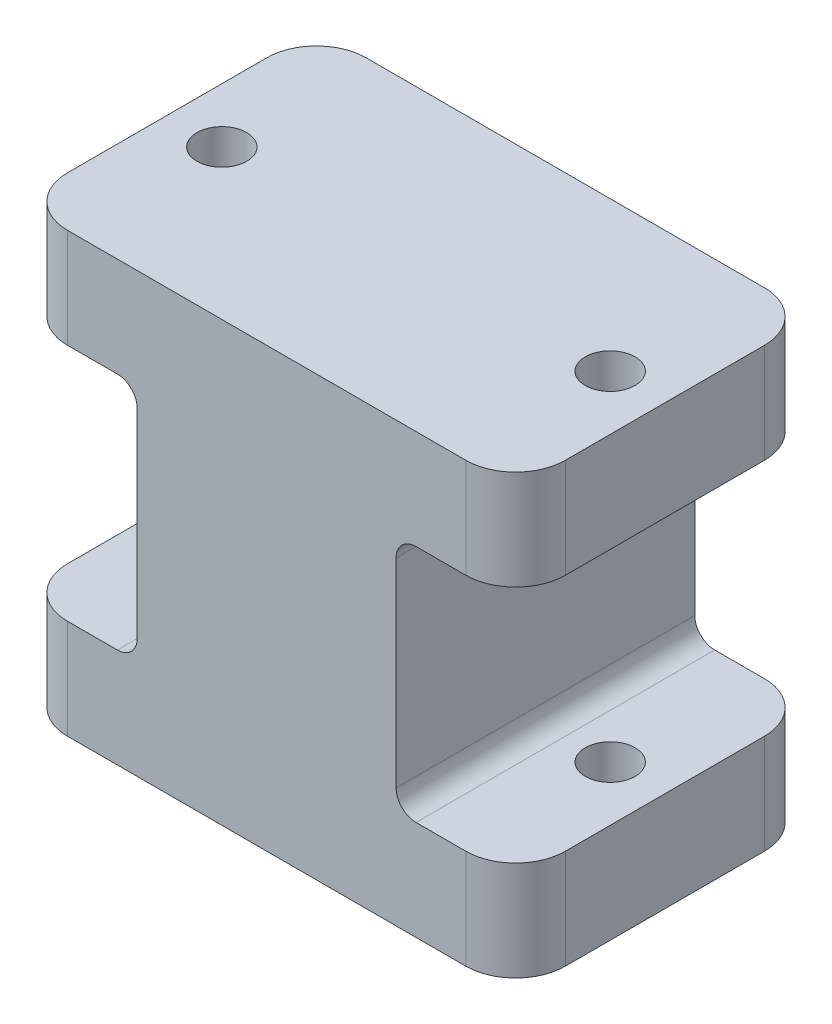
ISO-10303-21;
HEADER;
FILE_DESCRIPTION(('STEP AP214'),'2;1');
FILE_NAME('part.step','',(''),(''),'','','');
FILE_SCHEMA(('AUTOMOTIVE_DESIGN { 1 0 10303 214 1 1 1 1 }'));
ENDSEC;
DATA;
#1=APPLICATION_CONTEXT('core data for automotive mechanical design processes');
#2=APPLICATION_PROTOCOL_DEFINITION('international standard','automotive_design',2000,#1);
#3=PRODUCT_CONTEXT('',#1,'mechanical');
#4=PRODUCT('Part','Part','',(#3));
#5=PRODUCT_RELATED_PRODUCT_CATEGORY('part','',(#4));
#6=PRODUCT_DEFINITION_FORMATION('','',#4);
#7=PRODUCT_DEFINITION_CONTEXT('part definition',#1,'design');
#8=PRODUCT_DEFINITION('design','',#6,#7);
#9=PRODUCT_DEFINITION_SHAPE('','',#8);
#10=(LENGTH_UNIT() NAMED_UNIT(*) SI_UNIT(.MILLI.,.METRE.));
#11=(NAMED_UNIT(*) PLANE_ANGLE_UNIT() SI_UNIT($,.RADIAN.));
#12=(NAMED_UNIT(*) SI_UNIT($,.STERADIAN.) SOLID_ANGLE_UNIT());
#13=UNCERTAINTY_MEASURE_WITH_UNIT(LENGTH_MEASURE(1.E-05),#10,'distance_accuracy_value','');
#14=(GEOMETRIC_REPRESENTATION_CONTEXT(3) GLOBAL_UNCERTAINTY_ASSIGNED_CONTEXT((#13)) GLOBAL_UNIT_ASSIGNED_CONTEXT((#10,
#11,#12)) REPRESENTATION_CONTEXT('',''));
#15=CARTESIAN_POINT('',(0.,0.,0.));
#16=DIRECTION('',(0.,0.,1.));
#17=DIRECTION('',(1.,0.,0.));
#18=AXIS2_PLACEMENT_3D('',#15,#16,#17);
#19=CARTESIAN_POINT('',(20.,44.,10.));
#20=DIRECTION('',(0.,-1.,0.));
#21=DIRECTION('',(0.,0.,-1.));
#22=AXIS2_PLACEMENT_3D('',#19,#20,#21);
#23=CYLINDRICAL_SURFACE('',#22,5.);
#24=CARTESIAN_POINT('',(20.,9.99999999999999,10.));
#25=DIRECTION('',(0.,1.,0.));
#26=DIRECTION('',(0.,0.,1.));
#27=AXIS2_PLACEMENT_3D('',#24,#25,#26);
#28=CIRCLE('',#27,5.);
#29=CARTESIAN_POINT('',(20.,9.99999999999999,15.));
#30=VERTEX_POINT('',#29);
#31=CARTESIAN_POINT('',(25.,9.99999999999999,9.99999999999996));
#32=VERTEX_POINT('',#31);
#33=EDGE_CURVE('E415',#30,#32,#28,.T.);
#34=ORIENTED_EDGE('',*,*,#33,.F.);
#35=DIRECTION('',(0.,-1.,0.));
#36=VECTOR('',#35,1.);
#37=CARTESIAN_POINT('',(20.,44.,15.));
#38=LINE('',#37,#36);
#39=CARTESIAN_POINT('',(20.,0.,15.));
#40=VERTEX_POINT('',#39);
#41=EDGE_CURVE('E344',#30,#40,#38,.T.);
#42=ORIENTED_EDGE('',*,*,#41,.T.);
#43=CARTESIAN_POINT('',(20.,0.,10.));
#44=DIRECTION('',(0.,1.,0.));
#45=DIRECTION('',(0.,0.,1.));
#46=AXIS2_PLACEMENT_3D('',#43,#44,#45);
#47=CIRCLE('',#46,5.);
#48=CARTESIAN_POINT('',(25.,0.,9.99999999999996));
#49=VERTEX_POINT('',#48);
#50=EDGE_CURVE('E325',#40,#49,#47,.T.);
#51=ORIENTED_EDGE('',*,*,#50,.T.);
#52=DIRECTION('',(0.,-1.,0.));
#53=VECTOR('',#52,1.);
#54=CARTESIAN_POINT('',(25.,44.,9.99999999999996));
#55=LINE('',#54,#53);
#56=EDGE_CURVE('E219',#32,#49,#55,.T.);
#57=ORIENTED_EDGE('',*,*,#56,.F.);
#58=EDGE_LOOP('',(#34,#42,#51,#57));
#59=FACE_BOUND('',#58,.T.);
#60=ADVANCED_FACE('F33',(#59),#23,.T.);
#61=CARTESIAN_POINT('',(20.,34.,10.));
#62=DIRECTION('',(0.,-1.,0.));
#63=DIRECTION('',(0.,0.,-1.));
#64=AXIS2_PLACEMENT_3D('',#61,#62,#63);
#65=CIRCLE('',#64,5.);
#66=CARTESIAN_POINT('',(25.,34.,9.99999999999996));
#67=VERTEX_POINT('',#66);
#68=CARTESIAN_POINT('',(20.,34.,15.));
#69=VERTEX_POINT('',#68);
#70=EDGE_CURVE('E196',#67,#69,#65,.T.);
#71=ORIENTED_EDGE('',*,*,#70,.F.);
#72=CARTESIAN_POINT('',(25.,44.,9.99999999999996));
#73=VERTEX_POINT('',#72);
#74=EDGE_CURVE('E210',#73,#67,#55,.T.);
#75=ORIENTED_EDGE('',*,*,#74,.F.);
#76=CARTESIAN_POINT('',(20.,44.,10.));
#77=DIRECTION('',(0.,1.,0.));
#78=DIRECTION('',(0.,0.,1.));
#79=AXIS2_PLACEMENT_3D('',#76,#77,#78);
#80=CIRCLE('',#79,5.);
#81=CARTESIAN_POINT('',(20.,44.,15.));
#82=VERTEX_POINT('',#81);
#83=EDGE_CURVE('E328',#82,#73,#80,.T.);
#84=ORIENTED_EDGE('',*,*,#83,.F.);
#85=EDGE_CURVE('E212',#82,#69,#38,.T.);
#86=ORIENTED_EDGE('',*,*,#85,.T.);
#87=EDGE_LOOP('',(#71,#75,#84,#86));
#88=FACE_BOUND('',#87,.T.);
#89=ADVANCED_FACE('F208',(#88),#23,.T.);
#90=CARTESIAN_POINT('',(25.,44.,9.99999999999996));
#91=DIRECTION('',(-1.,0.,0.));
#92=DIRECTION('',(0.,0.,1.));
#93=AXIS2_PLACEMENT_3D('',#90,#91,#92);
#94=PLANE('',#93);
#95=DIRECTION('',(0.,0.,1.));
#96=VECTOR('',#95,1.);
#97=CARTESIAN_POINT('',(25.,9.99999999999999,15.));
#98=LINE('',#97,#96);
#99=CARTESIAN_POINT('',(25.,9.99999999999999,-10.));
#100=VERTEX_POINT('',#99);
#101=EDGE_CURVE('E204',#100,#32,#98,.T.);
#102=ORIENTED_EDGE('',*,*,#101,.T.);
#103=ORIENTED_EDGE('',*,*,#56,.T.);
#104=DIRECTION('',(0.,0.,-1.));
#105=VECTOR('',#104,1.);
#106=CARTESIAN_POINT('',(25.,0.,9.99999999999996));
#107=LINE('',#106,#105);
#108=CARTESIAN_POINT('',(25.,0.,-9.99999999999997));
#109=VERTEX_POINT('',#108);
#110=EDGE_CURVE('E347',#49,#109,#107,.T.);
#111=ORIENTED_EDGE('',*,*,#110,.T.);
#112=DIRECTION('',(0.,-1.,0.));
#113=VECTOR('',#112,1.);
#114=CARTESIAN_POINT('',(25.,44.,-9.99999999999997));
#115=LINE('',#114,#113);
#116=EDGE_CURVE('E386',#100,#109,#115,.T.);
#117=ORIENTED_EDGE('',*,*,#116,.F.);
#118=EDGE_LOOP('',(#102,#103,#111,#117));
#119=FACE_BOUND('',#118,.T.);
#120=ADVANCED_FACE('F446',(#119),#94,.F.);
#121=DIRECTION('',(0.,0.,-1.));
#122=VECTOR('',#121,1.);
#123=CARTESIAN_POINT('',(25.,34.,15.));
#124=LINE('',#123,#122);
#125=CARTESIAN_POINT('',(25.,34.,-10.));
#126=VERTEX_POINT('',#125);
#127=EDGE_CURVE('E192',#67,#126,#124,.T.);
#128=ORIENTED_EDGE('',*,*,#127,.T.);
#129=CARTESIAN_POINT('',(25.,44.,-9.99999999999997));
#130=VERTEX_POINT('',#129);
#131=EDGE_CURVE('E224',#130,#126,#115,.T.);
#132=ORIENTED_EDGE('',*,*,#131,.F.);
#133=DIRECTION('',(0.,0.,-1.));
#134=VECTOR('',#133,1.);
#135=CARTESIAN_POINT('',(25.,44.,9.99999999999996));
#136=LINE('',#135,#134);
#137=EDGE_CURVE('E216',#73,#130,#136,.T.);
#138=ORIENTED_EDGE('',*,*,#137,.F.);
#139=ORIENTED_EDGE('',*,*,#74,.T.);
#140=EDGE_LOOP('',(#128,#132,#138,#139));
#141=FACE_BOUND('',#140,.T.);
#142=ADVANCED_FACE('F215',(#141),#94,.F.);
#143=CARTESIAN_POINT('',(20.,44.,-10.));
#144=DIRECTION('',(0.,-1.,0.));
#145=DIRECTION('',(0.,0.,-1.));
#146=AXIS2_PLACEMENT_3D('',#143,#144,#145);
#147=CYLINDRICAL_SURFACE('',#146,5.);
#148=CARTESIAN_POINT('',(20.,9.99999999999999,-10.));
#149=DIRECTION('',(0.,1.,0.));
#150=DIRECTION('',(0.,0.,1.));
#151=AXIS2_PLACEMENT_3D('',#148,#149,#150);
#152=CIRCLE('',#151,5.);
#153=CARTESIAN_POINT('',(20.,9.99999999999999,-15.));
#154=VERTEX_POINT('',#153);
#155=EDGE_CURVE('E243',#100,#154,#152,.T.);
#156=ORIENTED_EDGE('',*,*,#155,.F.);
#157=ORIENTED_EDGE('',*,*,#116,.T.);
#158=CARTESIAN_POINT('',(20.,0.,-10.));
#159=DIRECTION('',(0.,1.,0.));
#160=DIRECTION('',(0.,0.,1.));
#161=AXIS2_PLACEMENT_3D('',#158,#159,#160);
#162=CIRCLE('',#161,5.);
#163=CARTESIAN_POINT('',(20.,0.,-15.));
#164=VERTEX_POINT('',#163);
#165=EDGE_CURVE('E350',#109,#164,#162,.T.);
#166=ORIENTED_EDGE('',*,*,#165,.T.);
#167=DIRECTION('',(0.,-1.,0.));
#168=VECTOR('',#167,1.);
#169=CARTESIAN_POINT('',(20.,44.,-15.));
#170=LINE('',#169,#168);
#171=EDGE_CURVE('E383',#154,#164,#170,.T.);
#172=ORIENTED_EDGE('',*,*,#171,.F.);
#173=EDGE_LOOP('',(#156,#157,#166,#172));
#174=FACE_BOUND('',#173,.T.);
#175=ADVANCED_FACE('F398',(#174),#147,.T.);
#176=CARTESIAN_POINT('',(20.,34.,-10.));
#177=DIRECTION('',(0.,-1.,0.));
#178=DIRECTION('',(0.,0.,-1.));
#179=AXIS2_PLACEMENT_3D('',#176,#177,#178);
#180=CIRCLE('',#179,5.);
#181=CARTESIAN_POINT('',(20.,34.,-15.));
#182=VERTEX_POINT('',#181);
#183=EDGE_CURVE('E199',#182,#126,#180,.T.);
#184=ORIENTED_EDGE('',*,*,#183,.F.);
#185=CARTESIAN_POINT('',(20.,44.,-15.));
#186=VERTEX_POINT('',#185);
#187=EDGE_CURVE('E384',#186,#182,#170,.T.);
#188=ORIENTED_EDGE('',*,*,#187,.F.);
#189=CARTESIAN_POINT('',(20.,44.,-10.));
#190=DIRECTION('',(0.,1.,0.));
#191=DIRECTION('',(0.,0.,1.));
#192=AXIS2_PLACEMENT_3D('',#189,#190,#191);
#193=CIRCLE('',#192,5.);
#194=EDGE_CURVE('E332',#130,#186,#193,.T.);
#195=ORIENTED_EDGE('',*,*,#194,.F.);
#196=ORIENTED_EDGE('',*,*,#131,.T.);
#197=EDGE_LOOP('',(#184,#188,#195,#196));
#198=FACE_BOUND('',#197,.T.);
#199=ADVANCED_FACE('F435',(#198),#147,.T.);
#200=CARTESIAN_POINT('',(20.,44.,-15.));
#201=DIRECTION('',(0.,0.,1.));
#202=DIRECTION('',(1.,0.,0.));
#203=AXIS2_PLACEMENT_3D('',#200,#201,#202);
#204=PLANE('',#203);
#205=DIRECTION('',(0.,-1.,0.));
#206=VECTOR('',#205,1.);
#207=CARTESIAN_POINT('',(13.,9.99999999999999,-15.));
#208=LINE('',#207,#206);
#209=CARTESIAN_POINT('',(13.,32.,-15.));
#210=VERTEX_POINT('',#209);
#211=CARTESIAN_POINT('',(13.,12.,-15.));
#212=VERTEX_POINT('',#211);
#213=EDGE_CURVE('E628',#210,#212,#208,.T.);
#214=ORIENTED_EDGE('',*,*,#213,.T.);
#215=CARTESIAN_POINT('',(15.,12.,-15.));
#216=DIRECTION('',(0.,0.,1.));
#217=DIRECTION('',(1.,0.,0.));
#218=AXIS2_PLACEMENT_3D('',#215,#216,#217);
#219=CIRCLE('',#218,2.);
#220=CARTESIAN_POINT('',(15.,9.99999999999999,-15.));
#221=VERTEX_POINT('',#220);
#222=EDGE_CURVE('E266',#212,#221,#219,.T.);
#223=ORIENTED_EDGE('',*,*,#222,.T.);
#224=DIRECTION('',(1.,0.,0.));
#225=VECTOR('',#224,1.);
#226=CARTESIAN_POINT('',(13.,9.99999999999999,-15.));
#227=LINE('',#226,#225);
#228=EDGE_CURVE('E241',#221,#154,#227,.T.);
#229=ORIENTED_EDGE('',*,*,#228,.T.);
#230=ORIENTED_EDGE('',*,*,#171,.T.);
#231=DIRECTION('',(-1.,0.,0.));
#232=VECTOR('',#231,1.);
#233=CARTESIAN_POINT('',(20.,0.,-15.));
#234=LINE('',#233,#232);
#235=CARTESIAN_POINT('',(-20.,0.,-15.));
#236=VERTEX_POINT('',#235);
#237=EDGE_CURVE('E353',#164,#236,#234,.T.);
#238=ORIENTED_EDGE('',*,*,#237,.T.);
#239=DIRECTION('',(0.,-1.,0.));
#240=VECTOR('',#239,1.);
#241=CARTESIAN_POINT('',(-20.,44.,-15.));
#242=LINE('',#241,#240);
#243=CARTESIAN_POINT('',(-20.,9.99999999999999,-15.));
#244=VERTEX_POINT('',#243);
#245=EDGE_CURVE('E380',#244,#236,#242,.T.);
#246=ORIENTED_EDGE('',*,*,#245,.F.);
#247=DIRECTION('',(-1.,0.,0.));
#248=VECTOR('',#247,1.);
#249=CARTESIAN_POINT('',(-13.,9.99999999999999,-15.));
#250=LINE('',#249,#248);
#251=CARTESIAN_POINT('',(-15.,9.99999999999999,-15.));
#252=VERTEX_POINT('',#251);
#253=EDGE_CURVE('E278',#252,#244,#250,.T.);
#254=ORIENTED_EDGE('',*,*,#253,.F.);
#255=CARTESIAN_POINT('',(-15.,12.,-15.));
#256=DIRECTION('',(0.,0.,1.));
#257=DIRECTION('',(1.,0.,0.));
#258=AXIS2_PLACEMENT_3D('',#255,#256,#257);
#259=CIRCLE('',#258,2.);
#260=CARTESIAN_POINT('',(-13.,12.,-15.));
#261=VERTEX_POINT('',#260);
#262=EDGE_CURVE('E270',#252,#261,#259,.T.);
#263=ORIENTED_EDGE('',*,*,#262,.T.);
#264=DIRECTION('',(0.,-1.,0.));
#265=VECTOR('',#264,1.);
#266=CARTESIAN_POINT('',(-13.,9.99999999999999,-15.));
#267=LINE('',#266,#265);
#268=CARTESIAN_POINT('',(-13.,32.,-15.));
#269=VERTEX_POINT('',#268);
#270=EDGE_CURVE('E276',#269,#261,#267,.T.);
#271=ORIENTED_EDGE('',*,*,#270,.F.);
#272=CARTESIAN_POINT('',(-15.,32.,-15.));
#273=DIRECTION('',(0.,0.,1.));
#274=DIRECTION('',(1.,0.,0.));
#275=AXIS2_PLACEMENT_3D('',#272,#273,#274);
#276=CIRCLE('',#275,2.);
#277=CARTESIAN_POINT('',(-15.,34.,-15.));
#278=VERTEX_POINT('',#277);
#279=EDGE_CURVE('E41',#269,#278,#276,.T.);
#280=ORIENTED_EDGE('',*,*,#279,.T.);
#281=DIRECTION('',(-1.,0.,0.));
#282=VECTOR('',#281,1.);
#283=CARTESIAN_POINT('',(-13.,34.,-15.));
#284=LINE('',#283,#282);
#285=CARTESIAN_POINT('',(-20.,34.,-15.));
#286=VERTEX_POINT('',#285);
#287=EDGE_CURVE('E232',#278,#286,#284,.T.);
#288=ORIENTED_EDGE('',*,*,#287,.T.);
#289=CARTESIAN_POINT('',(-20.,44.,-15.));
#290=VERTEX_POINT('',#289);
#291=EDGE_CURVE('E381',#290,#286,#242,.T.);
#292=ORIENTED_EDGE('',*,*,#291,.F.);
#293=DIRECTION('',(-1.,0.,0.));
#294=VECTOR('',#293,1.);
#295=CARTESIAN_POINT('',(20.,44.,-15.));
#296=LINE('',#295,#294);
#297=EDGE_CURVE('E334',#186,#290,#296,.T.);
#298=ORIENTED_EDGE('',*,*,#297,.F.);
#299=ORIENTED_EDGE('',*,*,#187,.T.);
#300=DIRECTION('',(1.,0.,0.));
#301=VECTOR('',#300,1.);
#302=CARTESIAN_POINT('',(13.,34.,-15.));
#303=LINE('',#302,#301);
#304=CARTESIAN_POINT('',(15.,34.,-15.));
#305=VERTEX_POINT('',#304);
#306=EDGE_CURVE('E438',#305,#182,#303,.T.);
#307=ORIENTED_EDGE('',*,*,#306,.F.);
#308=CARTESIAN_POINT('',(15.,32.,-15.));
#309=DIRECTION('',(0.,0.,1.));
#310=DIRECTION('',(1.,0.,0.));
#311=AXIS2_PLACEMENT_3D('',#308,#309,#310);
#312=CIRCLE('',#311,2.);
#313=EDGE_CURVE('E260',#305,#210,#312,.T.);
#314=ORIENTED_EDGE('',*,*,#313,.T.);
#315=EDGE_LOOP('',(#214,#223,#229,#230,#238,#246,#254,#263,#271,#280,#288,#292,#298,#299,#307,#314));
#316=FACE_BOUND('',#315,.T.);
#317=ADVANCED_FACE('F275',(#316),#204,.F.);
#318=CARTESIAN_POINT('',(20.,44.,15.));
#319=DIRECTION('',(0.,0.,-1.));
#320=DIRECTION('',(-1.,0.,0.));
#321=AXIS2_PLACEMENT_3D('',#318,#319,#320);
#322=PLANE('',#321);
#323=DIRECTION('',(1.,0.,0.));
#324=VECTOR('',#323,1.);
#325=CARTESIAN_POINT('',(13.,9.99999999999999,15.));
#326=LINE('',#325,#324);
#327=CARTESIAN_POINT('',(15.,9.99999999999999,15.));
#328=VERTEX_POINT('',#327);
#329=EDGE_CURVE('E639',#328,#30,#326,.T.);
#330=ORIENTED_EDGE('',*,*,#329,.F.);
#331=CARTESIAN_POINT('',(15.,12.,15.));
#332=DIRECTION('',(0.,0.,-1.));
#333=DIRECTION('',(-1.,0.,0.));
#334=AXIS2_PLACEMENT_3D('',#331,#332,#333);
#335=CIRCLE('',#334,2.);
#336=CARTESIAN_POINT('',(13.,12.,15.));
#337=VERTEX_POINT('',#336);
#338=EDGE_CURVE('E264',#328,#337,#335,.T.);
#339=ORIENTED_EDGE('',*,*,#338,.T.);
#340=DIRECTION('',(0.,1.,0.));
#341=VECTOR('',#340,1.);
#342=CARTESIAN_POINT('',(13.,9.99999999999999,15.));
#343=LINE('',#342,#341);
#344=CARTESIAN_POINT('',(13.,32.,15.));
#345=VERTEX_POINT('',#344);
#346=EDGE_CURVE('E634',#337,#345,#343,.T.);
#347=ORIENTED_EDGE('',*,*,#346,.T.);
#348=CARTESIAN_POINT('',(15.,32.,15.));
#349=DIRECTION('',(0.,0.,-1.));
#350=DIRECTION('',(-1.,0.,0.));
#351=AXIS2_PLACEMENT_3D('',#348,#349,#350);
#352=CIRCLE('',#351,2.);
#353=CARTESIAN_POINT('',(15.,34.,15.));
#354=VERTEX_POINT('',#353);
#355=EDGE_CURVE('E262',#345,#354,#352,.T.);
#356=ORIENTED_EDGE('',*,*,#355,.T.);
#357=DIRECTION('',(1.,0.,0.));
#358=VECTOR('',#357,1.);
#359=CARTESIAN_POINT('',(13.,34.,15.));
#360=LINE('',#359,#358);
#361=EDGE_CURVE('E638',#354,#69,#360,.T.);
#362=ORIENTED_EDGE('',*,*,#361,.T.);
#363=ORIENTED_EDGE('',*,*,#85,.F.);
#364=DIRECTION('',(1.,0.,0.));
#365=VECTOR('',#364,1.);
#366=CARTESIAN_POINT('',(20.,44.,15.));
#367=LINE('',#366,#365);
#368=CARTESIAN_POINT('',(-20.,44.,15.));
#369=VERTEX_POINT('',#368);
#370=EDGE_CURVE('E342',#369,#82,#367,.T.);
#371=ORIENTED_EDGE('',*,*,#370,.F.);
#372=DIRECTION('',(0.,-1.,0.));
#373=VECTOR('',#372,1.);
#374=CARTESIAN_POINT('',(-20.,44.,15.));
#375=LINE('',#374,#373);
#376=CARTESIAN_POINT('',(-20.,34.,15.));
#377=VERTEX_POINT('',#376);
#378=EDGE_CURVE('E369',#369,#377,#375,.T.);
#379=ORIENTED_EDGE('',*,*,#378,.T.);
#380=DIRECTION('',(-1.,0.,0.));
#381=VECTOR('',#380,1.);
#382=CARTESIAN_POINT('',(-13.,34.,15.));
#383=LINE('',#382,#381);
#384=CARTESIAN_POINT('',(-15.,34.,15.));
#385=VERTEX_POINT('',#384);
#386=EDGE_CURVE('E301',#385,#377,#383,.T.);
#387=ORIENTED_EDGE('',*,*,#386,.F.);
#388=CARTESIAN_POINT('',(-15.,32.,15.));
#389=DIRECTION('',(0.,0.,-1.));
#390=DIRECTION('',(-1.,0.,0.));
#391=AXIS2_PLACEMENT_3D('',#388,#389,#390);
#392=CIRCLE('',#391,2.);
#393=CARTESIAN_POINT('',(-13.,32.,15.));
#394=VERTEX_POINT('',#393);
#395=EDGE_CURVE('E11',#385,#394,#392,.T.);
#396=ORIENTED_EDGE('',*,*,#395,.T.);
#397=DIRECTION('',(0.,1.,0.));
#398=VECTOR('',#397,1.);
#399=CARTESIAN_POINT('',(-13.,9.99999999999999,15.));
#400=LINE('',#399,#398);
#401=CARTESIAN_POINT('',(-13.,12.,15.));
#402=VERTEX_POINT('',#401);
#403=EDGE_CURVE('E287',#402,#394,#400,.T.);
#404=ORIENTED_EDGE('',*,*,#403,.F.);
#405=CARTESIAN_POINT('',(-15.,12.,15.));
#406=DIRECTION('',(0.,0.,-1.));
#407=DIRECTION('',(-1.,0.,0.));
#408=AXIS2_PLACEMENT_3D('',#405,#406,#407);
#409=CIRCLE('',#408,2.);
#410=CARTESIAN_POINT('',(-15.,9.99999999999999,15.));
#411=VERTEX_POINT('',#410);
#412=EDGE_CURVE('E268',#402,#411,#409,.T.);
#413=ORIENTED_EDGE('',*,*,#412,.T.);
#414=DIRECTION('',(-1.,0.,0.));
#415=VECTOR('',#414,1.);
#416=CARTESIAN_POINT('',(-13.,9.99999999999999,15.));
#417=LINE('',#416,#415);
#418=CARTESIAN_POINT('',(-20.,9.99999999999999,15.));
#419=VERTEX_POINT('',#418);
#420=EDGE_CURVE('E295',#411,#419,#417,.T.);
#421=ORIENTED_EDGE('',*,*,#420,.T.);
#422=CARTESIAN_POINT('',(-20.,0.,15.));
#423=VERTEX_POINT('',#422);
#424=EDGE_CURVE('E368',#419,#423,#375,.T.);
#425=ORIENTED_EDGE('',*,*,#424,.T.);
#426=DIRECTION('',(1.,0.,0.));
#427=VECTOR('',#426,1.);
#428=CARTESIAN_POINT('',(20.,0.,15.));
#429=LINE('',#428,#427);
#430=EDGE_CURVE('E330',#423,#40,#429,.T.);
#431=ORIENTED_EDGE('',*,*,#430,.T.);
#432=ORIENTED_EDGE('',*,*,#41,.F.);
#433=EDGE_LOOP('',(#330,#339,#347,#356,#362,#363,#371,#379,#387,#396,#404,#413,#421,#425,#431,#432));
#434=FACE_BOUND('',#433,.T.);
#435=ADVANCED_FACE('F294',(#434),#322,.F.);
#436=CARTESIAN_POINT('',(19.5,44.,0.));
#437=DIRECTION('',(0.,-1.,0.));
#438=DIRECTION('',(0.,0.,-1.));
#439=AXIS2_PLACEMENT_3D('',#436,#437,#438);
#440=CYLINDRICAL_SURFACE('',#439,2.5);
#441=CARTESIAN_POINT('',(19.5,0.,0.));
#442=DIRECTION('',(0.,1.,0.));
#443=DIRECTION('',(0.,0.,-1.));
#444=AXIS2_PLACEMENT_3D('',#441,#442,#443);
#445=CIRCLE('',#444,2.5);
#446=CARTESIAN_POINT('',(19.5,0.,-2.5));
#447=VERTEX_POINT('',#446);
#448=EDGE_CURVE('E315',#447,#447,#445,.T.);
#449=ORIENTED_EDGE('',*,*,#448,.F.);
#450=EDGE_LOOP('',(#449));
#451=FACE_BOUND('',#450,.T.);
#452=CARTESIAN_POINT('',(19.5,9.99999999999999,0.));
#453=DIRECTION('',(0.,1.,0.));
#454=DIRECTION('',(0.,0.,1.));
#455=AXIS2_PLACEMENT_3D('',#452,#453,#454);
#456=CIRCLE('',#455,2.5);
#457=CARTESIAN_POINT('',(19.5,9.99999999999999,2.5));
#458=VERTEX_POINT('',#457);
#459=EDGE_CURVE('E213',#458,#458,#456,.T.);
#460=ORIENTED_EDGE('',*,*,#459,.T.);
#461=EDGE_LOOP('',(#460));
#462=FACE_BOUND('',#461,.T.);
#463=ADVANCED_FACE('F599',(#451,#462),#440,.F.);
#464=CARTESIAN_POINT('',(19.5,44.,0.));
#465=DIRECTION('',(0.,1.,0.));
#466=DIRECTION('',(0.,0.,-1.));
#467=AXIS2_PLACEMENT_3D('',#464,#465,#466);
#468=CIRCLE('',#467,2.5);
#469=CARTESIAN_POINT('',(19.5,44.,-2.5));
#470=VERTEX_POINT('',#469);
#471=EDGE_CURVE('E316',#470,#470,#468,.T.);
#472=ORIENTED_EDGE('',*,*,#471,.T.);
#473=EDGE_LOOP('',(#472));
#474=FACE_BOUND('',#473,.T.);
#475=CARTESIAN_POINT('',(19.5,34.,0.));
#476=DIRECTION('',(0.,-1.,0.));
#477=DIRECTION('',(0.,0.,-1.));
#478=AXIS2_PLACEMENT_3D('',#475,#476,#477);
#479=CIRCLE('',#478,2.5);
#480=CARTESIAN_POINT('',(19.5,34.,-2.5));
#481=VERTEX_POINT('',#480);
#482=EDGE_CURVE('E238',#481,#481,#479,.T.);
#483=ORIENTED_EDGE('',*,*,#482,.T.);
#484=EDGE_LOOP('',(#483));
#485=FACE_BOUND('',#484,.T.);
#486=ADVANCED_FACE('F502',(#474,#485),#440,.F.);
#487=CARTESIAN_POINT('',(-20.,44.,-9.99999999999999));
#488=DIRECTION('',(0.,-1.,0.));
#489=DIRECTION('',(0.,0.,-1.));
#490=AXIS2_PLACEMENT_3D('',#487,#488,#489);
#491=CYLINDRICAL_SURFACE('',#490,5.);
#492=ORIENTED_EDGE('',*,*,#291,.T.);
#493=CARTESIAN_POINT('',(-20.,34.,-9.99999999999999));
#494=DIRECTION('',(0.,1.,0.));
#495=DIRECTION('',(0.,0.,1.));
#496=AXIS2_PLACEMENT_3D('',#493,#494,#495);
#497=CIRCLE('',#496,5.);
#498=CARTESIAN_POINT('',(-25.,34.,-9.99999999999996));
#499=VERTEX_POINT('',#498);
#500=EDGE_CURVE('E312',#286,#499,#497,.T.);
#501=ORIENTED_EDGE('',*,*,#500,.T.);
#502=DIRECTION('',(0.,-1.,0.));
#503=VECTOR('',#502,1.);
#504=CARTESIAN_POINT('',(-25.,44.,-9.99999999999996));
#505=LINE('',#504,#503);
#506=CARTESIAN_POINT('',(-25.,44.,-9.99999999999996));
#507=VERTEX_POINT('',#506);
#508=EDGE_CURVE('E377',#507,#499,#505,.T.);
#509=ORIENTED_EDGE('',*,*,#508,.F.);
#510=CARTESIAN_POINT('',(-20.,44.,-9.99999999999999));
#511=DIRECTION('',(0.,1.,0.));
#512=DIRECTION('',(0.,0.,1.));
#513=AXIS2_PLACEMENT_3D('',#510,#511,#512);
#514=CIRCLE('',#513,5.);
#515=EDGE_CURVE('E336',#290,#507,#514,.T.);
#516=ORIENTED_EDGE('',*,*,#515,.F.);
#517=EDGE_LOOP('',(#492,#501,#509,#516));
#518=FACE_BOUND('',#517,.T.);
#519=ADVANCED_FACE('F427',(#518),#491,.T.);
#520=CARTESIAN_POINT('',(-25.,44.,9.99999999999997));
#521=DIRECTION('',(1.,0.,0.));
#522=DIRECTION('',(0.,0.,-1.));
#523=AXIS2_PLACEMENT_3D('',#520,#521,#522);
#524=PLANE('',#523);
#525=ORIENTED_EDGE('',*,*,#508,.T.);
#526=DIRECTION('',(0.,0.,-1.));
#527=VECTOR('',#526,1.);
#528=CARTESIAN_POINT('',(-25.,34.,15.));
#529=LINE('',#528,#527);
#530=CARTESIAN_POINT('',(-25.,34.,10.));
#531=VERTEX_POINT('',#530);
#532=EDGE_CURVE('E288',#531,#499,#529,.T.);
#533=ORIENTED_EDGE('',*,*,#532,.F.);
#534=DIRECTION('',(0.,-1.,0.));
#535=VECTOR('',#534,1.);
#536=CARTESIAN_POINT('',(-25.,44.,9.99999999999997));
#537=LINE('',#536,#535);
#538=CARTESIAN_POINT('',(-25.,44.,9.99999999999997));
#539=VERTEX_POINT('',#538);
#540=EDGE_CURVE('E373',#539,#531,#537,.T.);
#541=ORIENTED_EDGE('',*,*,#540,.F.);
#542=DIRECTION('',(0.,0.,1.));
#543=VECTOR('',#542,1.);
#544=CARTESIAN_POINT('',(-25.,44.,9.99999999999997));
#545=LINE('',#544,#543);
#546=EDGE_CURVE('E338',#507,#539,#545,.T.);
#547=ORIENTED_EDGE('',*,*,#546,.F.);
#548=EDGE_LOOP('',(#525,#533,#541,#547));
#549=FACE_BOUND('',#548,.T.);
#550=ADVANCED_FACE('F466',(#549),#524,.F.);
#551=CARTESIAN_POINT('',(-20.,44.,10.));
#552=DIRECTION('',(0.,-1.,0.));
#553=DIRECTION('',(0.,0.,-1.));
#554=AXIS2_PLACEMENT_3D('',#551,#552,#553);
#555=CYLINDRICAL_SURFACE('',#554,5.);
#556=ORIENTED_EDGE('',*,*,#540,.T.);
#557=CARTESIAN_POINT('',(-20.,34.,10.));
#558=DIRECTION('',(0.,1.,0.));
#559=DIRECTION('',(0.,0.,1.));
#560=AXIS2_PLACEMENT_3D('',#557,#558,#559);
#561=CIRCLE('',#560,5.);
#562=EDGE_CURVE('E236',#531,#377,#561,.T.);
#563=ORIENTED_EDGE('',*,*,#562,.T.);
#564=ORIENTED_EDGE('',*,*,#378,.F.);
#565=CARTESIAN_POINT('',(-20.,44.,10.));
#566=DIRECTION('',(0.,1.,0.));
#567=DIRECTION('',(0.,0.,-1.));
#568=AXIS2_PLACEMENT_3D('',#565,#566,#567);
#569=CIRCLE('',#568,5.);
#570=EDGE_CURVE('E340',#539,#369,#569,.T.);
#571=ORIENTED_EDGE('',*,*,#570,.F.);
#572=EDGE_LOOP('',(#556,#563,#564,#571));
#573=FACE_BOUND('',#572,.T.);
#574=ADVANCED_FACE('F457',(#573),#555,.T.);
#575=CARTESIAN_POINT('',(-19.5,44.,0.));
#576=DIRECTION('',(0.,-1.,0.));
#577=DIRECTION('',(0.,0.,-1.));
#578=AXIS2_PLACEMENT_3D('',#575,#576,#577);
#579=CYLINDRICAL_SURFACE('',#578,2.5);
#580=CARTESIAN_POINT('',(-19.5,34.,0.));
#581=DIRECTION('',(0.,1.,0.));
#582=DIRECTION('',(0.,0.,1.));
#583=AXIS2_PLACEMENT_3D('',#580,#581,#582);
#584=CIRCLE('',#583,2.5);
#585=CARTESIAN_POINT('',(-19.5,34.,2.5));
#586=VERTEX_POINT('',#585);
#587=EDGE_CURVE('E233',#586,#586,#584,.T.);
#588=ORIENTED_EDGE('',*,*,#587,.F.);
#589=EDGE_LOOP('',(#588));
#590=FACE_BOUND('',#589,.T.);
#591=CARTESIAN_POINT('',(-19.5,44.,0.));
#592=DIRECTION('',(0.,1.,0.));
#593=DIRECTION('',(0.,0.,1.));
#594=AXIS2_PLACEMENT_3D('',#591,#592,#593);
#595=CIRCLE('',#594,2.5);
#596=CARTESIAN_POINT('',(-19.5,44.,2.5));
#597=VERTEX_POINT('',#596);
#598=EDGE_CURVE('E322',#597,#597,#595,.T.);
#599=ORIENTED_EDGE('',*,*,#598,.T.);
#600=EDGE_LOOP('',(#599));
#601=FACE_BOUND('',#600,.T.);
#602=ADVANCED_FACE('F464',(#590,#601),#579,.F.);
#603=CARTESIAN_POINT('',(20.,44.,10.));
#604=DIRECTION('',(0.,1.,0.));
#605=DIRECTION('',(0.,0.,1.));
#606=AXIS2_PLACEMENT_3D('',#603,#604,#605);
#607=PLANE('',#606);
#608=ORIENTED_EDGE('',*,*,#598,.F.);
#609=EDGE_LOOP('',(#608));
#610=FACE_BOUND('',#609,.T.);
#611=ORIENTED_EDGE('',*,*,#83,.T.);
#612=ORIENTED_EDGE('',*,*,#137,.T.);
#613=ORIENTED_EDGE('',*,*,#194,.T.);
#614=ORIENTED_EDGE('',*,*,#297,.T.);
#615=ORIENTED_EDGE('',*,*,#515,.T.);
#616=ORIENTED_EDGE('',*,*,#546,.T.);
#617=ORIENTED_EDGE('',*,*,#570,.T.);
#618=ORIENTED_EDGE('',*,*,#370,.T.);
#619=EDGE_LOOP('',(#611,#612,#613,#614,#615,#616,#617,#618));
#620=FACE_BOUND('',#619,.T.);
#621=ORIENTED_EDGE('',*,*,#471,.F.);
#622=EDGE_LOOP('',(#621));
#623=FACE_BOUND('',#622,.T.);
#624=ADVANCED_FACE('F430',(#610,#620,#623),#607,.T.);
#625=CARTESIAN_POINT('',(20.,0.,10.));
#626=DIRECTION('',(0.,1.,0.));
#627=DIRECTION('',(0.,0.,1.));
#628=AXIS2_PLACEMENT_3D('',#625,#626,#627);
#629=PLANE('',#628);
#630=ORIENTED_EDGE('',*,*,#50,.F.);
#631=ORIENTED_EDGE('',*,*,#430,.F.);
#632=CARTESIAN_POINT('',(-20.,0.,10.));
#633=DIRECTION('',(0.,1.,0.));
#634=DIRECTION('',(0.,0.,-1.));
#635=AXIS2_PLACEMENT_3D('',#632,#633,#634);
#636=CIRCLE('',#635,5.);
#637=CARTESIAN_POINT('',(-25.,0.,9.99999999999997));
#638=VERTEX_POINT('',#637);
#639=EDGE_CURVE('E362',#638,#423,#636,.T.);
#640=ORIENTED_EDGE('',*,*,#639,.F.);
#641=DIRECTION('',(0.,0.,1.));
#642=VECTOR('',#641,1.);
#643=CARTESIAN_POINT('',(-25.,0.,9.99999999999997));
#644=LINE('',#643,#642);
#645=CARTESIAN_POINT('',(-25.,0.,-9.99999999999996));
#646=VERTEX_POINT('',#645);
#647=EDGE_CURVE('E359',#646,#638,#644,.T.);
#648=ORIENTED_EDGE('',*,*,#647,.F.);
#649=CARTESIAN_POINT('',(-20.,0.,-9.99999999999999));
#650=DIRECTION('',(0.,1.,0.));
#651=DIRECTION('',(0.,0.,1.));
#652=AXIS2_PLACEMENT_3D('',#649,#650,#651);
#653=CIRCLE('',#652,5.);
#654=EDGE_CURVE('E356',#236,#646,#653,.T.);
#655=ORIENTED_EDGE('',*,*,#654,.F.);
#656=ORIENTED_EDGE('',*,*,#237,.F.);
#657=ORIENTED_EDGE('',*,*,#165,.F.);
#658=ORIENTED_EDGE('',*,*,#110,.F.);
#659=EDGE_LOOP('',(#630,#631,#640,#648,#655,#656,#657,#658));
#660=FACE_BOUND('',#659,.T.);
#661=CARTESIAN_POINT('',(-19.5,0.,0.));
#662=DIRECTION('',(0.,1.,0.));
#663=DIRECTION('',(0.,0.,1.));
#664=AXIS2_PLACEMENT_3D('',#661,#662,#663);
#665=CIRCLE('',#664,2.5);
#666=CARTESIAN_POINT('',(-19.5,0.,2.5));
#667=VERTEX_POINT('',#666);
#668=EDGE_CURVE('E319',#667,#667,#665,.T.);
#669=ORIENTED_EDGE('',*,*,#668,.T.);
#670=EDGE_LOOP('',(#669));
#671=FACE_BOUND('',#670,.T.);
#672=ORIENTED_EDGE('',*,*,#448,.T.);
#673=EDGE_LOOP('',(#672));
#674=FACE_BOUND('',#673,.T.);
#675=ADVANCED_FACE('F403',(#660,#671,#674),#629,.F.);
#676=CARTESIAN_POINT('',(-25.,9.99999999999999,-9.99999999999996));
#677=VERTEX_POINT('',#676);
#678=EDGE_CURVE('E376',#677,#646,#505,.T.);
#679=ORIENTED_EDGE('',*,*,#678,.F.);
#680=CARTESIAN_POINT('',(-20.,9.99999999999999,-9.99999999999999));
#681=DIRECTION('',(0.,-1.,0.));
#682=DIRECTION('',(0.,0.,-1.));
#683=AXIS2_PLACEMENT_3D('',#680,#681,#682);
#684=CIRCLE('',#683,5.);
#685=EDGE_CURVE('E237',#677,#244,#684,.T.);
#686=ORIENTED_EDGE('',*,*,#685,.T.);
#687=ORIENTED_EDGE('',*,*,#245,.T.);
#688=ORIENTED_EDGE('',*,*,#654,.T.);
#689=EDGE_LOOP('',(#679,#686,#687,#688));
#690=FACE_BOUND('',#689,.T.);
#691=ADVANCED_FACE('F409',(#690),#491,.T.);
#692=CARTESIAN_POINT('',(-25.,9.99999999999999,10.));
#693=VERTEX_POINT('',#692);
#694=EDGE_CURVE('E372',#693,#638,#537,.T.);
#695=ORIENTED_EDGE('',*,*,#694,.F.);
#696=DIRECTION('',(0.,0.,1.));
#697=VECTOR('',#696,1.);
#698=CARTESIAN_POINT('',(-25.,9.99999999999999,15.));
#699=LINE('',#698,#697);
#700=EDGE_CURVE('E411',#677,#693,#699,.T.);
#701=ORIENTED_EDGE('',*,*,#700,.F.);
#702=ORIENTED_EDGE('',*,*,#678,.T.);
#703=ORIENTED_EDGE('',*,*,#647,.T.);
#704=EDGE_LOOP('',(#695,#701,#702,#703));
#705=FACE_BOUND('',#704,.T.);
#706=ADVANCED_FACE('F414',(#705),#524,.F.);
#707=ORIENTED_EDGE('',*,*,#424,.F.);
#708=CARTESIAN_POINT('',(-20.,9.99999999999999,10.));
#709=DIRECTION('',(0.,-1.,0.));
#710=DIRECTION('',(0.,0.,-1.));
#711=AXIS2_PLACEMENT_3D('',#708,#709,#710);
#712=CIRCLE('',#711,5.);
#713=EDGE_CURVE('E231',#419,#693,#712,.T.);
#714=ORIENTED_EDGE('',*,*,#713,.T.);
#715=ORIENTED_EDGE('',*,*,#694,.T.);
#716=ORIENTED_EDGE('',*,*,#639,.T.);
#717=EDGE_LOOP('',(#707,#714,#715,#716));
#718=FACE_BOUND('',#717,.T.);
#719=ADVANCED_FACE('F453',(#718),#555,.T.);
#720=CARTESIAN_POINT('',(-19.5,9.99999999999999,0.));
#721=DIRECTION('',(0.,-1.,0.));
#722=DIRECTION('',(0.,0.,-1.));
#723=AXIS2_PLACEMENT_3D('',#720,#721,#722);
#724=CIRCLE('',#723,2.5);
#725=CARTESIAN_POINT('',(-19.5,9.99999999999999,-2.5));
#726=VERTEX_POINT('',#725);
#727=EDGE_CURVE('E228',#726,#726,#724,.T.);
#728=ORIENTED_EDGE('',*,*,#727,.F.);
#729=EDGE_LOOP('',(#728));
#730=FACE_BOUND('',#729,.T.);
#731=ORIENTED_EDGE('',*,*,#668,.F.);
#732=EDGE_LOOP('',(#731));
#733=FACE_BOUND('',#732,.T.);
#734=ADVANCED_FACE('F455',(#730,#733),#579,.F.);
#735=CARTESIAN_POINT('',(-13.,34.,15.));
#736=DIRECTION('',(0.,1.,0.));
#737=DIRECTION('',(0.,0.,1.));
#738=AXIS2_PLACEMENT_3D('',#735,#736,#737);
#739=PLANE('',#738);
#740=ORIENTED_EDGE('',*,*,#587,.T.);
#741=EDGE_LOOP('',(#740));
#742=FACE_BOUND('',#741,.T.);
#743=ORIENTED_EDGE('',*,*,#287,.F.);
#744=DIRECTION('',(0.,0.,-1.));
#745=VECTOR('',#744,1.);
#746=CARTESIAN_POINT('',(-15.,34.,15.));
#747=LINE('',#746,#745);
#748=EDGE_CURVE('E48',#278,#385,#747,.F.);
#749=ORIENTED_EDGE('',*,*,#748,.T.);
#750=ORIENTED_EDGE('',*,*,#386,.T.);
#751=ORIENTED_EDGE('',*,*,#562,.F.);
#752=ORIENTED_EDGE('',*,*,#532,.T.);
#753=ORIENTED_EDGE('',*,*,#500,.F.);
#754=EDGE_LOOP('',(#743,#749,#750,#751,#752,#753));
#755=FACE_BOUND('',#754,.T.);
#756=ADVANCED_FACE('F423',(#742,#755),#739,.F.);
#757=CARTESIAN_POINT('',(-13.,9.99999999999999,15.));
#758=DIRECTION('',(0.,-1.,0.));
#759=DIRECTION('',(0.,0.,-1.));
#760=AXIS2_PLACEMENT_3D('',#757,#758,#759);
#761=PLANE('',#760);
#762=ORIENTED_EDGE('',*,*,#727,.T.);
#763=EDGE_LOOP('',(#762));
#764=FACE_BOUND('',#763,.T.);
#765=ORIENTED_EDGE('',*,*,#420,.F.);
#766=DIRECTION('',(0.,0.,1.));
#767=VECTOR('',#766,1.);
#768=CARTESIAN_POINT('',(-15.,9.99999999999999,15.));
#769=LINE('',#768,#767);
#770=EDGE_CURVE('E257',#411,#252,#769,.F.);
#771=ORIENTED_EDGE('',*,*,#770,.T.);
#772=ORIENTED_EDGE('',*,*,#253,.T.);
#773=ORIENTED_EDGE('',*,*,#685,.F.);
#774=ORIENTED_EDGE('',*,*,#700,.T.);
#775=ORIENTED_EDGE('',*,*,#713,.F.);
#776=EDGE_LOOP('',(#765,#771,#772,#773,#774,#775));
#777=FACE_BOUND('',#776,.T.);
#778=ADVANCED_FACE('F298',(#764,#777),#761,.F.);
#779=CARTESIAN_POINT('',(-13.,0.,0.));
#780=DIRECTION('',(-1.,0.,0.));
#781=DIRECTION('',(0.,0.,1.));
#782=AXIS2_PLACEMENT_3D('',#779,#780,#781);
#783=PLANE('',#782);
#784=ORIENTED_EDGE('',*,*,#270,.T.);
#785=DIRECTION('',(0.,0.,1.));
#786=VECTOR('',#785,1.);
#787=CARTESIAN_POINT('',(-13.,12.,0.));
#788=LINE('',#787,#786);
#789=EDGE_CURVE('E254',#261,#402,#788,.T.);
#790=ORIENTED_EDGE('',*,*,#789,.T.);
#791=ORIENTED_EDGE('',*,*,#403,.T.);
#792=DIRECTION('',(0.,0.,-1.));
#793=VECTOR('',#792,1.);
#794=CARTESIAN_POINT('',(-13.,32.,0.));
#795=LINE('',#794,#793);
#796=EDGE_CURVE('E251',#394,#269,#795,.T.);
#797=ORIENTED_EDGE('',*,*,#796,.T.);
#798=EDGE_LOOP('',(#784,#790,#791,#797));
#799=FACE_BOUND('',#798,.T.);
#800=ADVANCED_FACE('F283',(#799),#783,.T.);
#801=CARTESIAN_POINT('',(13.,9.99999999999999,15.));
#802=DIRECTION('',(0.,1.,0.));
#803=DIRECTION('',(0.,0.,1.));
#804=AXIS2_PLACEMENT_3D('',#801,#802,#803);
#805=PLANE('',#804);
#806=ORIENTED_EDGE('',*,*,#459,.F.);
#807=EDGE_LOOP('',(#806));
#808=FACE_BOUND('',#807,.T.);
#809=ORIENTED_EDGE('',*,*,#228,.F.);
#810=DIRECTION('',(0.,0.,1.));
#811=VECTOR('',#810,1.);
#812=CARTESIAN_POINT('',(15.,9.99999999999999,15.));
#813=LINE('',#812,#811);
#814=EDGE_CURVE('E248',#221,#328,#813,.T.);
#815=ORIENTED_EDGE('',*,*,#814,.T.);
#816=ORIENTED_EDGE('',*,*,#329,.T.);
#817=ORIENTED_EDGE('',*,*,#33,.T.);
#818=ORIENTED_EDGE('',*,*,#101,.F.);
#819=ORIENTED_EDGE('',*,*,#155,.T.);
#820=EDGE_LOOP('',(#809,#815,#816,#817,#818,#819));
#821=FACE_BOUND('',#820,.T.);
#822=ADVANCED_FACE('F442',(#808,#821),#805,.T.);
#823=CARTESIAN_POINT('',(13.,34.,15.));
#824=DIRECTION('',(0.,-1.,0.));
#825=DIRECTION('',(0.,0.,-1.));
#826=AXIS2_PLACEMENT_3D('',#823,#824,#825);
#827=PLANE('',#826);
#828=ORIENTED_EDGE('',*,*,#482,.F.);
#829=EDGE_LOOP('',(#828));
#830=FACE_BOUND('',#829,.T.);
#831=ORIENTED_EDGE('',*,*,#361,.F.);
#832=DIRECTION('',(0.,0.,-1.));
#833=VECTOR('',#832,1.);
#834=CARTESIAN_POINT('',(15.,34.,-15.));
#835=LINE('',#834,#833);
#836=EDGE_CURVE('E218',#354,#305,#835,.T.);
#837=ORIENTED_EDGE('',*,*,#836,.T.);
#838=ORIENTED_EDGE('',*,*,#306,.T.);
#839=ORIENTED_EDGE('',*,*,#183,.T.);
#840=ORIENTED_EDGE('',*,*,#127,.F.);
#841=ORIENTED_EDGE('',*,*,#70,.T.);
#842=EDGE_LOOP('',(#831,#837,#838,#839,#840,#841));
#843=FACE_BOUND('',#842,.T.);
#844=ADVANCED_FACE('F195',(#830,#843),#827,.T.);
#845=CARTESIAN_POINT('',(13.,0.,0.));
#846=DIRECTION('',(1.,0.,0.));
#847=DIRECTION('',(0.,0.,1.));
#848=AXIS2_PLACEMENT_3D('',#845,#846,#847);
#849=PLANE('',#848);
#850=ORIENTED_EDGE('',*,*,#213,.F.);
#851=DIRECTION('',(0.,0.,-1.));
#852=VECTOR('',#851,1.);
#853=CARTESIAN_POINT('',(13.,32.,15.));
#854=LINE('',#853,#852);
#855=EDGE_CURVE('E246',#210,#345,#854,.F.);
#856=ORIENTED_EDGE('',*,*,#855,.T.);
#857=ORIENTED_EDGE('',*,*,#346,.F.);
#858=DIRECTION('',(0.,0.,1.));
#859=VECTOR('',#858,1.);
#860=CARTESIAN_POINT('',(13.,12.,-15.));
#861=LINE('',#860,#859);
#862=EDGE_CURVE('E222',#337,#212,#861,.F.);
#863=ORIENTED_EDGE('',*,*,#862,.T.);
#864=EDGE_LOOP('',(#850,#856,#857,#863));
#865=FACE_BOUND('',#864,.T.);
#866=ADVANCED_FACE('F482',(#865),#849,.T.);
#867=CARTESIAN_POINT('',(15.,32.,15.));
#868=DIRECTION('',(0.,0.,1.));
#869=DIRECTION('',(1.,0.,0.));
#870=AXIS2_PLACEMENT_3D('',#867,#868,#869);
#871=CYLINDRICAL_SURFACE('',#870,2.);
#872=ORIENTED_EDGE('',*,*,#355,.F.);
#873=ORIENTED_EDGE('',*,*,#855,.F.);
#874=ORIENTED_EDGE('',*,*,#313,.F.);
#875=ORIENTED_EDGE('',*,*,#836,.F.);
#876=EDGE_LOOP('',(#872,#873,#874,#875));
#877=FACE_BOUND('',#876,.T.);
#878=ADVANCED_FACE('F478',(#877),#871,.F.);
#879=CARTESIAN_POINT('',(15.,12.,15.));
#880=DIRECTION('',(0.,0.,-1.));
#881=DIRECTION('',(0.,1.,0.));
#882=AXIS2_PLACEMENT_3D('',#879,#880,#881);
#883=CYLINDRICAL_SURFACE('',#882,2.);
#884=ORIENTED_EDGE('',*,*,#222,.F.);
#885=ORIENTED_EDGE('',*,*,#862,.F.);
#886=ORIENTED_EDGE('',*,*,#338,.F.);
#887=ORIENTED_EDGE('',*,*,#814,.F.);
#888=EDGE_LOOP('',(#884,#885,#886,#887));
#889=FACE_BOUND('',#888,.T.);
#890=ADVANCED_FACE('F481',(#889),#883,.F.);
#891=CARTESIAN_POINT('',(-15.,12.,0.));
#892=DIRECTION('',(0.,0.,1.));
#893=DIRECTION('',(0.,-1.,0.));
#894=AXIS2_PLACEMENT_3D('',#891,#892,#893);
#895=CYLINDRICAL_SURFACE('',#894,2.);
#896=ORIENTED_EDGE('',*,*,#262,.F.);
#897=ORIENTED_EDGE('',*,*,#770,.F.);
#898=ORIENTED_EDGE('',*,*,#412,.F.);
#899=ORIENTED_EDGE('',*,*,#789,.F.);
#900=EDGE_LOOP('',(#896,#897,#898,#899));
#901=FACE_BOUND('',#900,.T.);
#902=ADVANCED_FACE('F290',(#901),#895,.F.);
#903=CARTESIAN_POINT('',(-15.,32.,0.));
#904=DIRECTION('',(0.,0.,-1.));
#905=DIRECTION('',(-1.,0.,0.));
#906=AXIS2_PLACEMENT_3D('',#903,#904,#905);
#907=CYLINDRICAL_SURFACE('',#906,2.);
#908=ORIENTED_EDGE('',*,*,#395,.F.);
#909=ORIENTED_EDGE('',*,*,#748,.F.);
#910=ORIENTED_EDGE('',*,*,#279,.F.);
#911=ORIENTED_EDGE('',*,*,#796,.F.);
#912=EDGE_LOOP('',(#908,#909,#910,#911));
#913=FACE_BOUND('',#912,.T.);
#914=ADVANCED_FACE('F35',(#913),#907,.F.);
#915=CLOSED_SHELL('',(#60,#89,#120,#142,#175,#199,#317,#435,#463,#486,#519,#550,#574,#602,#624,
#675,#691,#706,#719,#734,#756,#778,#800,#822,#844,#866,#878,#890,#902,#914));
#916=MANIFOLD_SOLID_BREP('B2',#915);
#917=ADVANCED_BREP_SHAPE_REPRESENTATION('',(#18,#916),#14);
#918=SHAPE_DEFINITION_REPRESENTATION(#9,#917);
ENDSEC;
END-ISO-10303-21;
